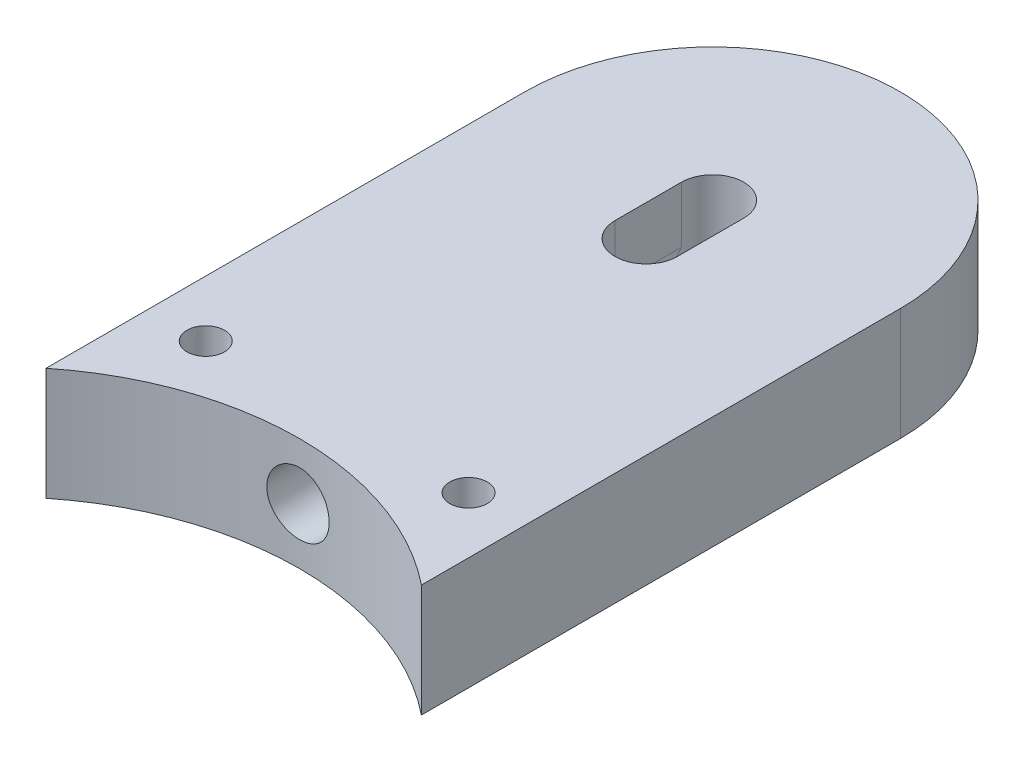
ISO-10303-21;
HEADER;
FILE_DESCRIPTION(('STEP AP214'),'2;1');
FILE_NAME('part.step','',(''),(''),'','','');
FILE_SCHEMA(('AUTOMOTIVE_DESIGN { 1 0 10303 214 1 1 1 1 }'));
ENDSEC;
DATA;
#1=APPLICATION_CONTEXT('core data for automotive mechanical design processes');
#2=APPLICATION_PROTOCOL_DEFINITION('international standard','automotive_design',2000,#1);
#3=PRODUCT_CONTEXT('',#1,'mechanical');
#4=PRODUCT('Part','Part','',(#3));
#5=PRODUCT_RELATED_PRODUCT_CATEGORY('part','',(#4));
#6=PRODUCT_DEFINITION_FORMATION('','',#4);
#7=PRODUCT_DEFINITION_CONTEXT('part definition',#1,'design');
#8=PRODUCT_DEFINITION('design','',#6,#7);
#9=PRODUCT_DEFINITION_SHAPE('','',#8);
#10=(LENGTH_UNIT() NAMED_UNIT(*) SI_UNIT(.MILLI.,.METRE.));
#11=(NAMED_UNIT(*) PLANE_ANGLE_UNIT() SI_UNIT($,.RADIAN.));
#12=(NAMED_UNIT(*) SI_UNIT($,.STERADIAN.) SOLID_ANGLE_UNIT());
#13=UNCERTAINTY_MEASURE_WITH_UNIT(LENGTH_MEASURE(1.E-05),#10,'distance_accuracy_value','');
#14=(GEOMETRIC_REPRESENTATION_CONTEXT(3) GLOBAL_UNCERTAINTY_ASSIGNED_CONTEXT((#13)) GLOBAL_UNIT_ASSIGNED_CONTEXT((#10,
#11,#12)) REPRESENTATION_CONTEXT('',''));
#15=CARTESIAN_POINT('',(0.,0.,0.));
#16=DIRECTION('',(0.,0.,1.));
#17=DIRECTION('',(1.,0.,0.));
#18=AXIS2_PLACEMENT_3D('',#15,#16,#17);
#19=CARTESIAN_POINT('',(0.,7.5,-120.001));
#20=DIRECTION('',(0.,0.,1.));
#21=DIRECTION('',(1.,0.,0.));
#22=AXIS2_PLACEMENT_3D('',#19,#20,#21);
#23=CYLINDRICAL_SURFACE('',#22,4.15);
#24=CARTESIAN_POINT('',(4.15,7.5,-39.7841362857107));
#25=CARTESIAN_POINT('',(4.14998995471438,7.73243328006865,-39.7841391061069));
#26=CARTESIAN_POINT('',(4.13040702542489,7.96501910444815,-39.7861951810044));
#27=CARTESIAN_POINT('',(4.0525845631117,8.42373891951209,-39.7941959246612));
#28=CARTESIAN_POINT('',(3.99430272878014,8.64986556731828,-39.8001448485437));
#29=CARTESIAN_POINT('',(3.84080073903238,9.08895784694395,-39.8152503567264));
#30=CARTESIAN_POINT('',(3.74560334066775,9.30193149350637,-39.8244049645068));
#31=CARTESIAN_POINT('',(3.52101696533275,9.70883268881792,-39.8448879240278));
#32=CARTESIAN_POINT('',(3.39163465000705,9.90276393828719,-39.8562158521337));
#33=CARTESIAN_POINT('',(3.10180894111617,10.2668773410144,-39.8798186000088));
#34=CARTESIAN_POINT('',(2.94125923262005,10.4369746741982,-39.8920965717091));
#35=CARTESIAN_POINT('',(2.59388363990017,10.7478610860331,-39.9161874182379));
#36=CARTESIAN_POINT('',(2.40705654022177,10.8886488082273,-39.92800027152));
#37=CARTESIAN_POINT('',(2.01190771750454,11.1372144948199,-39.9498612097241));
#38=CARTESIAN_POINT('',(1.80353836039996,11.2449171210434,-39.9599052450137));
#39=CARTESIAN_POINT('',(1.37155021141628,11.4237732861452,-39.9770625019232));
#40=CARTESIAN_POINT('',(1.14793181770878,11.4949277789278,-39.9841758000342));
#41=CARTESIAN_POINT('',(0.692652083801801,11.5984183534877,-39.9946479708498));
#42=CARTESIAN_POINT('',(0.461022790409489,11.6308940292657,-39.9980203417253));
#43=CARTESIAN_POINT('',(-0.00442142212582524,11.6565371282544,-40.000676617609));
#44=CARTESIAN_POINT('',(-0.2382362804247,11.6497056425059,-39.9999606360967));
#45=CARTESIAN_POINT('',(-0.700466556393305,11.5970414595779,-39.9945319094648));
#46=CARTESIAN_POINT('',(-0.928899282629586,11.5513588712267,-39.9898345474231));
#47=CARTESIAN_POINT('',(-1.37483782648857,11.4225232029036,-39.9769885440279));
#48=CARTESIAN_POINT('',(-1.5923434928812,11.3393696044931,-39.9688398549228));
#49=CARTESIAN_POINT('',(-2.01072574148317,11.1377884310803,-39.9499807847555));
#50=CARTESIAN_POINT('',(-2.21157019021818,11.019294630435,-39.9392656017109));
#51=CARTESIAN_POINT('',(-2.59057814728641,10.7504447548613,-39.9164754027479));
#52=CARTESIAN_POINT('',(-2.76874093898432,10.6000876736005,-39.9044003438865));
#53=CARTESIAN_POINT('',(-3.09820777225917,10.2709355759895,-39.8801778276573));
#54=CARTESIAN_POINT('',(-3.24938134886674,10.0920099450446,-39.8680302971782));
#55=CARTESIAN_POINT('',(-3.51956790248982,9.71125207493328,-39.8450886110781));
#56=CARTESIAN_POINT('',(-3.63858082680812,9.50941979823369,-39.8342944576746));
#57=CARTESIAN_POINT('',(-3.84106819928328,9.08847548211954,-39.815280873723));
#58=CARTESIAN_POINT('',(-3.92453426352564,8.86935938065082,-39.807062050701));
#59=CARTESIAN_POINT('',(-4.05345369156975,8.42011833023073,-39.7941421379067));
#60=CARTESIAN_POINT('',(-4.09890830398811,8.18999374315342,-39.7894409325868));
#61=CARTESIAN_POINT('',(-4.15034604388866,7.7264143950357,-39.7841087092421));
#62=CARTESIAN_POINT('',(-4.15651183878142,7.49298011028332,-39.7834588553776));
#63=CARTESIAN_POINT('',(-4.12967694946025,7.02840170613471,-39.786253193042));
#64=CARTESIAN_POINT('',(-4.09667683567846,6.79725755343326,-39.789697324944));
#65=CARTESIAN_POINT('',(-3.99259984411867,6.34435522546579,-39.8002744237486));
#66=CARTESIAN_POINT('',(-3.92160962093336,6.12257692412623,-39.8073989943747));
#67=CARTESIAN_POINT('',(-3.7436561276664,5.69407562334665,-39.8245273986872));
#68=CARTESIAN_POINT('',(-3.63669197272399,5.48735299438735,-39.8345313031966));
#69=CARTESIAN_POINT('',(-3.38937049239023,5.09399936649603,-39.8563367182822));
#70=CARTESIAN_POINT('',(-3.24889229172627,4.90744473114777,-39.8681446788006));
#71=CARTESIAN_POINT('',(-2.93870330588269,4.5604977202909,-39.8922067544438));
#72=CARTESIAN_POINT('',(-2.76899174126562,4.40010604257677,-39.9044608814575));
#73=CARTESIAN_POINT('',(-2.40436030756734,4.10940635059518,-39.9280915553903));
#74=CARTESIAN_POINT('',(-2.20934507554558,3.97921761929979,-39.9394645083564));
#75=CARTESIAN_POINT('',(-1.80011210777366,3.75344083821018,-39.9599989010739));
#76=CARTESIAN_POINT('',(-1.585894652581,3.65785228298669,-39.9691603731293));
#77=CARTESIAN_POINT('',(-1.14475173430347,3.50419067986083,-39.9842233616797));
#78=CARTESIAN_POINT('',(-0.917851439589215,3.44604601138412,-39.9901310985839));
#79=CARTESIAN_POINT('',(-0.457444110391158,3.36868904785623,-39.9980465413306));
#80=CARTESIAN_POINT('',(-0.223937277001919,3.34947556907953,-40.000054365752));
#81=CARTESIAN_POINT('',(0.241884052869568,3.3505437626865,-39.9999436283739));
#82=CARTESIAN_POINT('',(0.474199000283562,3.37064043306161,-39.9978443952601));
#83=CARTESIAN_POINT('',(0.932133279760155,3.44936998759833,-39.9897935841204));
#84=CARTESIAN_POINT('',(1.15775260770096,3.50800289548214,-39.9838420037232));
#85=CARTESIAN_POINT('',(1.59588653598986,3.66208832683122,-39.9687531477412));
#86=CARTESIAN_POINT('',(1.80840322896878,3.75753495299222,-39.9596163824238));
#87=CARTESIAN_POINT('',(2.2144293002581,3.98251887353046,-39.9391747127251));
#88=CARTESIAN_POINT('',(2.40793874310307,4.11205605215589,-39.9278698157055));
#89=CARTESIAN_POINT('',(2.77140517098323,4.40223675957684,-39.9042941148272));
#90=CARTESIAN_POINT('',(2.9412518715896,4.56301809331095,-39.8920191803401));
#91=CARTESIAN_POINT('',(3.25163501739993,4.91084835964633,-39.8679215920657));
#92=CARTESIAN_POINT('',(3.39216443339268,5.09790357381439,-39.8560990472985));
#93=CARTESIAN_POINT('',(3.64022960902796,5.49353265296908,-39.8342104917123));
#94=CARTESIAN_POINT('',(3.74767472374551,5.7021635812614,-39.8241493387164));
#95=CARTESIAN_POINT('',(3.9258625072027,6.134479567967,-39.8069804170902));
#96=CARTESIAN_POINT('',(3.99664637376701,6.35814740788964,-39.7998693351348));
#97=CARTESIAN_POINT('',(4.08194608660678,6.73588968452559,-39.7911900247703));
#98=CARTESIAN_POINT('',(4.10743118330917,6.88755315085826,-39.7885574705756));
#99=CARTESIAN_POINT('',(4.1414614209344,7.19278886724919,-39.7850296729066));
#100=CARTESIAN_POINT('',(4.15000663995511,7.34636110850415,-39.7841344214228));
#101=CARTESIAN_POINT('',(4.15,7.5,-39.7841362857107));
#102=B_SPLINE_CURVE_WITH_KNOTS('',3,(#24,#25,#26,#27,#28,#29,#30,#31,#32,#33,#34,#35,#36,#37,
#38,#39,#40,#41,#42,#43,#44,#45,#46,#47,#48,#49,#50,#51,#52,#53,#54,#55,#56,#57,#58,#59,#60,#61,
#62,#63,#64,#65,#66,#67,#68,#69,#70,#71,#72,#73,#74,#75,#76,#77,#78,#79,#80,#81,#82,#83,#84,#85,
#86,#87,#88,#89,#90,#91,#92,#93,#94,#95,#96,#97,#98,#99,#100,#101),.UNSPECIFIED.,.T.,.F.,(4,2,2,
2,2,2,2,2,2,2,2,2,2,2,2,2,2,2,2,2,2,2,2,2,2,2,2,2,2,2,2,2,2,2,2,2,2,2,4),(0.,0.696738751384701,
1.39424035604831,2.09131265911425,2.78824922314974,3.4876062566671,4.18699564942679,
4.88796601631237,5.58891808697954,6.28733264179561,6.98572781095576,7.68143678920701,
8.37715539339184,9.07418601739818,9.771238658881,10.4715746106645,11.1719117099849,
11.8724138961521,12.5728930710162,13.2701130830717,13.9673229405863,14.6629492144536,
15.3585926000843,16.0567839415919,16.7549939015771,17.4559161200356,18.1568280992138,
18.856395399499,19.5559414287135,20.252203164106,20.9484653281051,21.6446160019918,
22.3407643121838,23.0400557415796,23.7395146432451,24.4408732238424,25.141441938148,
25.6019898550011,26.0625356485868),.UNSPECIFIED.);
#103=CARTESIAN_POINT('',(4.15,7.5,-39.7841362857107));
#104=VERTEX_POINT('',#103);
#105=EDGE_CURVE('E132',#104,#104,#102,.T.);
#106=ORIENTED_EDGE('',*,*,#105,.T.);
#107=EDGE_LOOP('',(#106));
#108=FACE_BOUND('',#107,.T.);
#109=DIRECTION('',(0.,0.,1.));
#110=VECTOR('',#109,1.);
#111=CARTESIAN_POINT('',(-4.15000000000002,7.5,-95.));
#112=LINE('',#111,#110);
#113=CARTESIAN_POINT('',(-4.15000000000002,7.5,-95.));
#114=VERTEX_POINT('',#113);
#115=CARTESIAN_POINT('',(-4.15000000000002,7.5,-86.15));
#116=VERTEX_POINT('',#115);
#117=EDGE_CURVE('E111',#114,#116,#112,.T.);
#118=ORIENTED_EDGE('',*,*,#117,.T.);
#119=CARTESIAN_POINT('',(0.,7.5,-86.15));
#120=DIRECTION('',(0.,-0.707106781186547,0.707106781186547));
#121=DIRECTION('',(0.,0.707106781186547,0.707106781186547));
#122=AXIS2_PLACEMENT_3D('',#119,#120,#121);
#123=ELLIPSE('',#122,5.86898628384836,4.15000000000001);
#124=CARTESIAN_POINT('',(4.15000000000002,7.5,-86.15));
#125=VERTEX_POINT('',#124);
#126=EDGE_CURVE('E11',#116,#125,#123,.F.);
#127=ORIENTED_EDGE('',*,*,#126,.T.);
#128=DIRECTION('',(0.,0.,-1.));
#129=VECTOR('',#128,1.);
#130=CARTESIAN_POINT('',(4.15000000000002,7.5,-86.15));
#131=LINE('',#130,#129);
#132=CARTESIAN_POINT('',(4.14999999999998,7.5,-95.));
#133=VERTEX_POINT('',#132);
#134=EDGE_CURVE('E120',#125,#133,#131,.T.);
#135=ORIENTED_EDGE('',*,*,#134,.T.);
#136=CARTESIAN_POINT('',(0.,7.5,-95.));
#137=DIRECTION('',(0.,0.707106781186547,0.707106781186547));
#138=DIRECTION('',(0.,-0.707106781186547,0.707106781186547));
#139=AXIS2_PLACEMENT_3D('',#136,#137,#138);
#140=ELLIPSE('',#139,5.86898628384834,4.15);
#141=EDGE_CURVE('E128',#114,#133,#140,.T.);
#142=ORIENTED_EDGE('',*,*,#141,.F.);
#143=EDGE_LOOP('',(#118,#127,#135,#142));
#144=FACE_BOUND('',#143,.T.);
#145=ADVANCED_FACE('F35',(#108,#144),#23,.F.);
#146=CARTESIAN_POINT('',(0.,15.,0.));
#147=DIRECTION('',(0.,1.,0.));
#148=DIRECTION('',(0.,0.,1.));
#149=AXIS2_PLACEMENT_3D('',#146,#147,#148);
#150=PLANE('',#149);
#151=CARTESIAN_POINT('',(17.5,15.,-45.));
#152=DIRECTION('',(0.,-1.,0.));
#153=DIRECTION('',(0.,0.,-1.));
#154=AXIS2_PLACEMENT_3D('',#151,#152,#153);
#155=CIRCLE('',#154,2.5);
#156=CARTESIAN_POINT('',(17.5,15.,-47.5));
#157=VERTEX_POINT('',#156);
#158=EDGE_CURVE('E320',#157,#157,#155,.T.);
#159=ORIENTED_EDGE('',*,*,#158,.T.);
#160=EDGE_LOOP('',(#159));
#161=FACE_BOUND('',#160,.T.);
#162=CARTESIAN_POINT('',(-17.5,15.,-45.));
#163=DIRECTION('',(0.,-1.,0.));
#164=DIRECTION('',(0.,0.,-1.));
#165=AXIS2_PLACEMENT_3D('',#162,#163,#164);
#166=CIRCLE('',#165,2.5);
#167=CARTESIAN_POINT('',(-17.5,15.,-47.5));
#168=VERTEX_POINT('',#167);
#169=EDGE_CURVE('E308',#168,#168,#166,.T.);
#170=ORIENTED_EDGE('',*,*,#169,.T.);
#171=EDGE_LOOP('',(#170));
#172=FACE_BOUND('',#171,.T.);
#173=DIRECTION('',(0.,0.,-1.));
#174=VECTOR('',#173,1.);
#175=CARTESIAN_POINT('',(4.15000000000002,15.,-86.15));
#176=LINE('',#175,#174);
#177=CARTESIAN_POINT('',(4.15000000000002,15.,-86.15));
#178=VERTEX_POINT('',#177);
#179=CARTESIAN_POINT('',(4.15000000000002,15.,-95.));
#180=VERTEX_POINT('',#179);
#181=EDGE_CURVE('E121',#178,#180,#176,.T.);
#182=ORIENTED_EDGE('',*,*,#181,.F.);
#183=CARTESIAN_POINT('',(0.,15.,-86.15));
#184=DIRECTION('',(0.,1.,0.));
#185=DIRECTION('',(0.,0.,1.));
#186=AXIS2_PLACEMENT_3D('',#183,#184,#185);
#187=CIRCLE('',#186,4.15000000000002);
#188=CARTESIAN_POINT('',(-4.15000000000002,15.,-86.15));
#189=VERTEX_POINT('',#188);
#190=EDGE_CURVE('E303',#189,#178,#187,.T.);
#191=ORIENTED_EDGE('',*,*,#190,.F.);
#192=DIRECTION('',(0.,0.,1.));
#193=VECTOR('',#192,1.);
#194=CARTESIAN_POINT('',(-4.15000000000002,15.,-95.));
#195=LINE('',#194,#193);
#196=CARTESIAN_POINT('',(-4.15000000000002,15.,-95.));
#197=VERTEX_POINT('',#196);
#198=EDGE_CURVE('E306',#197,#189,#195,.T.);
#199=ORIENTED_EDGE('',*,*,#198,.F.);
#200=CARTESIAN_POINT('',(0.,15.,-95.));
#201=DIRECTION('',(0.,1.,0.));
#202=DIRECTION('',(0.,0.,1.));
#203=AXIS2_PLACEMENT_3D('',#200,#201,#202);
#204=CIRCLE('',#203,4.15);
#205=EDGE_CURVE('E130',#180,#197,#204,.T.);
#206=ORIENTED_EDGE('',*,*,#205,.F.);
#207=EDGE_LOOP('',(#182,#191,#199,#206));
#208=FACE_BOUND('',#207,.T.);
#209=CARTESIAN_POINT('',(0.,15.,0.));
#210=DIRECTION('',(0.,-1.,0.));
#211=DIRECTION('',(0.,0.,1.));
#212=AXIS2_PLACEMENT_3D('',#209,#210,#211);
#213=CIRCLE('',#212,40.);
#214=CARTESIAN_POINT('',(-25.,15.,-31.224989991992));
#215=VERTEX_POINT('',#214);
#216=CARTESIAN_POINT('',(25.,15.,-31.224989991992));
#217=VERTEX_POINT('',#216);
#218=EDGE_CURVE('E148',#215,#217,#213,.T.);
#219=ORIENTED_EDGE('',*,*,#218,.T.);
#220=DIRECTION('',(0.,0.,-1.));
#221=VECTOR('',#220,1.);
#222=CARTESIAN_POINT('',(25.,15.,-31.224989991992));
#223=LINE('',#222,#221);
#224=CARTESIAN_POINT('',(25.,15.,-95.));
#225=VERTEX_POINT('',#224);
#226=EDGE_CURVE('E88',#217,#225,#223,.T.);
#227=ORIENTED_EDGE('',*,*,#226,.T.);
#228=CARTESIAN_POINT('',(0.,15.,-95.));
#229=DIRECTION('',(0.,1.,0.));
#230=DIRECTION('',(0.,0.,-1.));
#231=AXIS2_PLACEMENT_3D('',#228,#229,#230);
#232=CIRCLE('',#231,25.);
#233=CARTESIAN_POINT('',(-25.,15.,-95.));
#234=VERTEX_POINT('',#233);
#235=EDGE_CURVE('E151',#225,#234,#232,.T.);
#236=ORIENTED_EDGE('',*,*,#235,.T.);
#237=DIRECTION('',(0.,0.,1.));
#238=VECTOR('',#237,1.);
#239=CARTESIAN_POINT('',(-25.,15.,-31.224989991992));
#240=LINE('',#239,#238);
#241=EDGE_CURVE('E59',#234,#215,#240,.T.);
#242=ORIENTED_EDGE('',*,*,#241,.T.);
#243=EDGE_LOOP('',(#219,#227,#236,#242));
#244=FACE_BOUND('',#243,.T.);
#245=ADVANCED_FACE('F181',(#161,#172,#208,#244),#150,.T.);
#246=CARTESIAN_POINT('',(0.,0.,0.));
#247=DIRECTION('',(0.,1.,0.));
#248=DIRECTION('',(0.,0.,1.));
#249=AXIS2_PLACEMENT_3D('',#246,#247,#248);
#250=PLANE('',#249);
#251=CARTESIAN_POINT('',(17.5,0.,-45.));
#252=DIRECTION('',(0.,-1.,0.));
#253=DIRECTION('',(0.,0.,-1.));
#254=AXIS2_PLACEMENT_3D('',#251,#252,#253);
#255=CIRCLE('',#254,2.5);
#256=CARTESIAN_POINT('',(17.5,0.,-47.5));
#257=VERTEX_POINT('',#256);
#258=EDGE_CURVE('E322',#257,#257,#255,.T.);
#259=ORIENTED_EDGE('',*,*,#258,.F.);
#260=EDGE_LOOP('',(#259));
#261=FACE_BOUND('',#260,.T.);
#262=CARTESIAN_POINT('',(-17.5,0.,-45.));
#263=DIRECTION('',(0.,-1.,0.));
#264=DIRECTION('',(0.,0.,-1.));
#265=AXIS2_PLACEMENT_3D('',#262,#263,#264);
#266=CIRCLE('',#265,2.5);
#267=CARTESIAN_POINT('',(-17.5,0.,-47.5));
#268=VERTEX_POINT('',#267);
#269=EDGE_CURVE('E317',#268,#268,#266,.T.);
#270=ORIENTED_EDGE('',*,*,#269,.F.);
#271=EDGE_LOOP('',(#270));
#272=FACE_BOUND('',#271,.T.);
#273=CARTESIAN_POINT('',(0.,0.,0.));
#274=DIRECTION('',(0.,-1.,0.));
#275=DIRECTION('',(0.,0.,1.));
#276=AXIS2_PLACEMENT_3D('',#273,#274,#275);
#277=CIRCLE('',#276,40.);
#278=CARTESIAN_POINT('',(-25.,0.,-31.224989991992));
#279=VERTEX_POINT('',#278);
#280=CARTESIAN_POINT('',(25.,0.,-31.224989991992));
#281=VERTEX_POINT('',#280);
#282=EDGE_CURVE('E145',#279,#281,#277,.T.);
#283=ORIENTED_EDGE('',*,*,#282,.F.);
#284=DIRECTION('',(0.,0.,1.));
#285=VECTOR('',#284,1.);
#286=CARTESIAN_POINT('',(-25.,0.,-31.224989991992));
#287=LINE('',#286,#285);
#288=CARTESIAN_POINT('',(-25.,0.,-95.));
#289=VERTEX_POINT('',#288);
#290=EDGE_CURVE('E80',#289,#279,#287,.T.);
#291=ORIENTED_EDGE('',*,*,#290,.F.);
#292=CARTESIAN_POINT('',(0.,0.,-95.));
#293=DIRECTION('',(0.,1.,0.));
#294=DIRECTION('',(0.,0.,-1.));
#295=AXIS2_PLACEMENT_3D('',#292,#293,#294);
#296=CIRCLE('',#295,25.);
#297=CARTESIAN_POINT('',(25.,0.,-95.));
#298=VERTEX_POINT('',#297);
#299=EDGE_CURVE('E159',#298,#289,#296,.T.);
#300=ORIENTED_EDGE('',*,*,#299,.F.);
#301=DIRECTION('',(0.,0.,-1.));
#302=VECTOR('',#301,1.);
#303=CARTESIAN_POINT('',(25.,0.,-31.224989991992));
#304=LINE('',#303,#302);
#305=EDGE_CURVE('E157',#281,#298,#304,.T.);
#306=ORIENTED_EDGE('',*,*,#305,.F.);
#307=EDGE_LOOP('',(#283,#291,#300,#306));
#308=FACE_BOUND('',#307,.T.);
#309=CARTESIAN_POINT('',(0.,0.,-95.));
#310=DIRECTION('',(0.,1.,0.));
#311=DIRECTION('',(0.,0.,1.));
#312=AXIS2_PLACEMENT_3D('',#309,#310,#311);
#313=CIRCLE('',#312,4.15);
#314=CARTESIAN_POINT('',(0.,0.,-90.85));
#315=VERTEX_POINT('',#314);
#316=EDGE_CURVE('E135',#315,#315,#313,.T.);
#317=ORIENTED_EDGE('',*,*,#316,.T.);
#318=EDGE_LOOP('',(#317));
#319=FACE_BOUND('',#318,.T.);
#320=ADVANCED_FACE('F173',(#261,#272,#308,#319),#250,.F.);
#321=CARTESIAN_POINT('',(0.,15.,0.));
#322=DIRECTION('',(0.,-1.,0.));
#323=DIRECTION('',(0.,0.,-1.));
#324=AXIS2_PLACEMENT_3D('',#321,#322,#323);
#325=CYLINDRICAL_SURFACE('',#324,40.);
#326=ORIENTED_EDGE('',*,*,#105,.F.);
#327=EDGE_LOOP('',(#326));
#328=FACE_BOUND('',#327,.T.);
#329=ORIENTED_EDGE('',*,*,#282,.T.);
#330=DIRECTION('',(0.,-1.,0.));
#331=VECTOR('',#330,1.);
#332=CARTESIAN_POINT('',(25.,15.,-31.224989991992));
#333=LINE('',#332,#331);
#334=EDGE_CURVE('E43',#217,#281,#333,.T.);
#335=ORIENTED_EDGE('',*,*,#334,.F.);
#336=ORIENTED_EDGE('',*,*,#218,.F.);
#337=DIRECTION('',(0.,-1.,0.));
#338=VECTOR('',#337,1.);
#339=CARTESIAN_POINT('',(-25.,15.,-31.224989991992));
#340=LINE('',#339,#338);
#341=EDGE_CURVE('E154',#215,#279,#340,.T.);
#342=ORIENTED_EDGE('',*,*,#341,.T.);
#343=EDGE_LOOP('',(#329,#335,#336,#342));
#344=FACE_BOUND('',#343,.T.);
#345=ADVANCED_FACE('F37',(#328,#344),#325,.F.);
#346=CARTESIAN_POINT('',(25.,15.,-31.224989991992));
#347=DIRECTION('',(-1.,0.,0.));
#348=DIRECTION('',(0.,0.,1.));
#349=AXIS2_PLACEMENT_3D('',#346,#347,#348);
#350=PLANE('',#349);
#351=ORIENTED_EDGE('',*,*,#305,.T.);
#352=DIRECTION('',(0.,-1.,0.));
#353=VECTOR('',#352,1.);
#354=CARTESIAN_POINT('',(25.,15.,-95.));
#355=LINE('',#354,#353);
#356=EDGE_CURVE('E165',#225,#298,#355,.T.);
#357=ORIENTED_EDGE('',*,*,#356,.F.);
#358=ORIENTED_EDGE('',*,*,#226,.F.);
#359=ORIENTED_EDGE('',*,*,#334,.T.);
#360=EDGE_LOOP('',(#351,#357,#358,#359));
#361=FACE_BOUND('',#360,.T.);
#362=ADVANCED_FACE('F168',(#361),#350,.F.);
#363=CARTESIAN_POINT('',(0.,15.,-95.));
#364=DIRECTION('',(0.,-1.,0.));
#365=DIRECTION('',(0.,0.,-1.));
#366=AXIS2_PLACEMENT_3D('',#363,#364,#365);
#367=CYLINDRICAL_SURFACE('',#366,25.);
#368=ORIENTED_EDGE('',*,*,#299,.T.);
#369=DIRECTION('',(0.,-1.,0.));
#370=VECTOR('',#369,1.);
#371=CARTESIAN_POINT('',(-25.,15.,-95.));
#372=LINE('',#371,#370);
#373=EDGE_CURVE('E163',#234,#289,#372,.T.);
#374=ORIENTED_EDGE('',*,*,#373,.F.);
#375=ORIENTED_EDGE('',*,*,#235,.F.);
#376=ORIENTED_EDGE('',*,*,#356,.T.);
#377=EDGE_LOOP('',(#368,#374,#375,#376));
#378=FACE_BOUND('',#377,.T.);
#379=ADVANCED_FACE('F178',(#378),#367,.T.);
#380=CARTESIAN_POINT('',(-25.,15.,-31.224989991992));
#381=DIRECTION('',(1.,0.,0.));
#382=DIRECTION('',(0.,0.,-1.));
#383=AXIS2_PLACEMENT_3D('',#380,#381,#382);
#384=PLANE('',#383);
#385=ORIENTED_EDGE('',*,*,#290,.T.);
#386=ORIENTED_EDGE('',*,*,#341,.F.);
#387=ORIENTED_EDGE('',*,*,#241,.F.);
#388=ORIENTED_EDGE('',*,*,#373,.T.);
#389=EDGE_LOOP('',(#385,#386,#387,#388));
#390=FACE_BOUND('',#389,.T.);
#391=ADVANCED_FACE('F180',(#390),#384,.F.);
#392=CARTESIAN_POINT('',(0.,15.,-95.));
#393=DIRECTION('',(0.,-1.,0.));
#394=DIRECTION('',(0.,0.,-1.));
#395=AXIS2_PLACEMENT_3D('',#392,#393,#394);
#396=CYLINDRICAL_SURFACE('',#395,4.15);
#397=DIRECTION('',(0.,1.,0.));
#398=VECTOR('',#397,1.);
#399=CARTESIAN_POINT('',(4.15000000000002,7.5,-95.));
#400=LINE('',#399,#398);
#401=EDGE_CURVE('E50',#133,#180,#400,.T.);
#402=ORIENTED_EDGE('',*,*,#401,.T.);
#403=ORIENTED_EDGE('',*,*,#205,.T.);
#404=DIRECTION('',(0.,1.,0.));
#405=VECTOR('',#404,1.);
#406=CARTESIAN_POINT('',(-4.15000000000002,7.5,-95.));
#407=LINE('',#406,#405);
#408=EDGE_CURVE('E115',#114,#197,#407,.T.);
#409=ORIENTED_EDGE('',*,*,#408,.F.);
#410=ORIENTED_EDGE('',*,*,#141,.T.);
#411=EDGE_LOOP('',(#402,#403,#409,#410));
#412=FACE_BOUND('',#411,.T.);
#413=ORIENTED_EDGE('',*,*,#316,.F.);
#414=EDGE_LOOP('',(#413));
#415=FACE_BOUND('',#414,.T.);
#416=ADVANCED_FACE('F126',(#412,#415),#396,.F.);
#417=CARTESIAN_POINT('',(0.,7.5,-86.15));
#418=DIRECTION('',(0.,1.,0.));
#419=DIRECTION('',(0.,0.,1.));
#420=AXIS2_PLACEMENT_3D('',#417,#418,#419);
#421=CYLINDRICAL_SURFACE('',#420,4.15000000000002);
#422=DIRECTION('',(0.,1.,0.));
#423=VECTOR('',#422,1.);
#424=CARTESIAN_POINT('',(-4.15000000000002,7.5,-86.15));
#425=LINE('',#424,#423);
#426=EDGE_CURVE('E117',#116,#189,#425,.T.);
#427=ORIENTED_EDGE('',*,*,#426,.T.);
#428=ORIENTED_EDGE('',*,*,#190,.T.);
#429=DIRECTION('',(0.,1.,0.));
#430=VECTOR('',#429,1.);
#431=CARTESIAN_POINT('',(4.15000000000002,7.5,-86.15));
#432=LINE('',#431,#430);
#433=EDGE_CURVE('E137',#125,#178,#432,.T.);
#434=ORIENTED_EDGE('',*,*,#433,.F.);
#435=ORIENTED_EDGE('',*,*,#126,.F.);
#436=EDGE_LOOP('',(#427,#428,#434,#435));
#437=FACE_BOUND('',#436,.T.);
#438=ADVANCED_FACE('F254',(#437),#421,.F.);
#439=CARTESIAN_POINT('',(4.15000000000002,7.5,-86.15));
#440=DIRECTION('',(1.,0.,0.));
#441=DIRECTION('',(0.,0.,-1.));
#442=AXIS2_PLACEMENT_3D('',#439,#440,#441);
#443=PLANE('',#442);
#444=ORIENTED_EDGE('',*,*,#181,.T.);
#445=ORIENTED_EDGE('',*,*,#401,.F.);
#446=ORIENTED_EDGE('',*,*,#134,.F.);
#447=ORIENTED_EDGE('',*,*,#433,.T.);
#448=EDGE_LOOP('',(#444,#445,#446,#447));
#449=FACE_BOUND('',#448,.T.);
#450=ADVANCED_FACE('F248',(#449),#443,.F.);
#451=CARTESIAN_POINT('',(-4.15000000000002,7.5,-95.));
#452=DIRECTION('',(-1.,0.,0.));
#453=DIRECTION('',(0.,0.,1.));
#454=AXIS2_PLACEMENT_3D('',#451,#452,#453);
#455=PLANE('',#454);
#456=ORIENTED_EDGE('',*,*,#198,.T.);
#457=ORIENTED_EDGE('',*,*,#426,.F.);
#458=ORIENTED_EDGE('',*,*,#117,.F.);
#459=ORIENTED_EDGE('',*,*,#408,.T.);
#460=EDGE_LOOP('',(#456,#457,#458,#459));
#461=FACE_BOUND('',#460,.T.);
#462=ADVANCED_FACE('F114',(#461),#455,.F.);
#463=CARTESIAN_POINT('',(-17.5,0.,-45.));
#464=DIRECTION('',(0.,-1.,0.));
#465=DIRECTION('',(0.,0.,-1.));
#466=AXIS2_PLACEMENT_3D('',#463,#464,#465);
#467=CYLINDRICAL_SURFACE('',#466,2.5);
#468=ORIENTED_EDGE('',*,*,#169,.F.);
#469=EDGE_LOOP('',(#468));
#470=FACE_BOUND('',#469,.T.);
#471=ORIENTED_EDGE('',*,*,#269,.T.);
#472=EDGE_LOOP('',(#471));
#473=FACE_BOUND('',#472,.T.);
#474=ADVANCED_FACE('F221',(#470,#473),#467,.F.);
#475=CARTESIAN_POINT('',(17.5,0.,-45.));
#476=DIRECTION('',(0.,-1.,0.));
#477=DIRECTION('',(0.,0.,-1.));
#478=AXIS2_PLACEMENT_3D('',#475,#476,#477);
#479=CYLINDRICAL_SURFACE('',#478,2.5);
#480=ORIENTED_EDGE('',*,*,#158,.F.);
#481=EDGE_LOOP('',(#480));
#482=FACE_BOUND('',#481,.T.);
#483=ORIENTED_EDGE('',*,*,#258,.T.);
#484=EDGE_LOOP('',(#483));
#485=FACE_BOUND('',#484,.T.);
#486=ADVANCED_FACE('F227',(#482,#485),#479,.F.);
#487=CLOSED_SHELL('',(#145,#245,#320,#345,#362,#379,#391,#416,#438,#450,#462,#474,#486));
#488=MANIFOLD_SOLID_BREP('B2',#487);
#489=ADVANCED_BREP_SHAPE_REPRESENTATION('',(#18,#488),#14);
#490=SHAPE_DEFINITION_REPRESENTATION(#9,#489);
ENDSEC;
END-ISO-10303-21;
